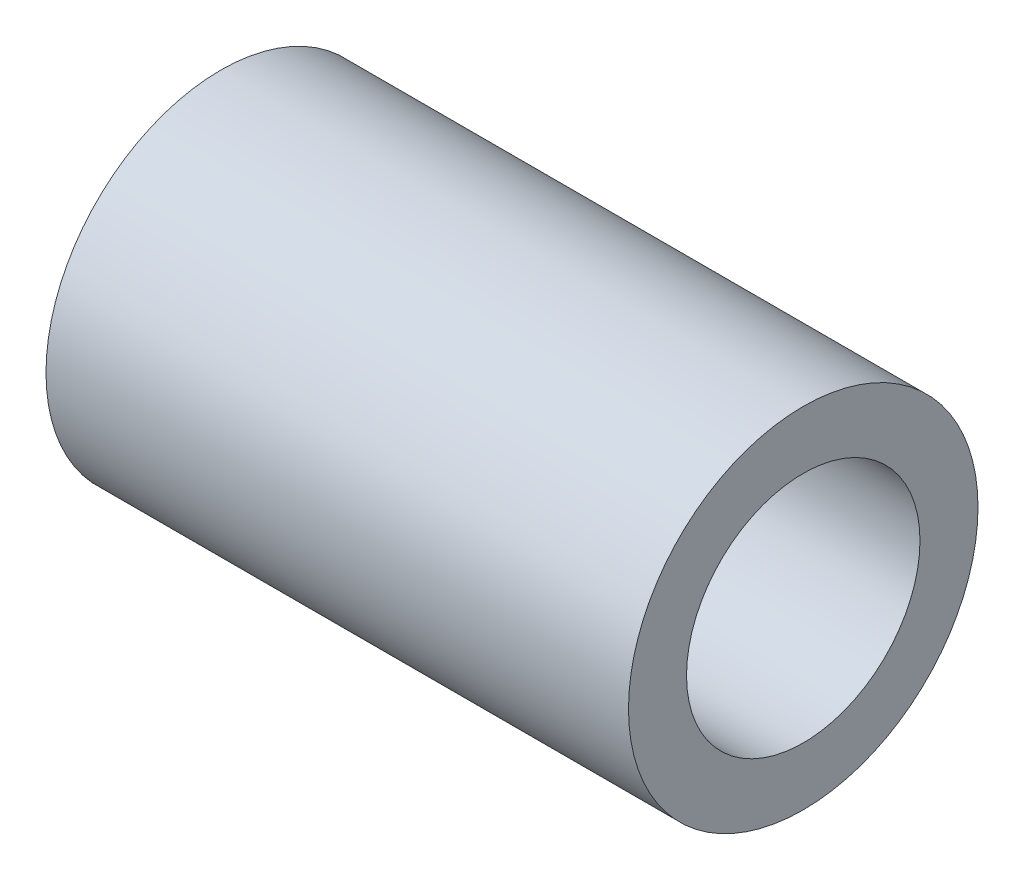
ISO-10303-21;
HEADER;
FILE_DESCRIPTION(('STEP AP214'),'2;1');
FILE_NAME('part.step','',(''),(''),'','','');
FILE_SCHEMA(('AUTOMOTIVE_DESIGN { 1 0 10303 214 1 1 1 1 }'));
ENDSEC;
DATA;
#1=APPLICATION_CONTEXT('core data for automotive mechanical design processes');
#2=APPLICATION_PROTOCOL_DEFINITION('international standard','automotive_design',2000,#1);
#3=PRODUCT_CONTEXT('',#1,'mechanical');
#4=PRODUCT('Part','Part','',(#3));
#5=PRODUCT_RELATED_PRODUCT_CATEGORY('part','',(#4));
#6=PRODUCT_DEFINITION_FORMATION('','',#4);
#7=PRODUCT_DEFINITION_CONTEXT('part definition',#1,'design');
#8=PRODUCT_DEFINITION('design','',#6,#7);
#9=PRODUCT_DEFINITION_SHAPE('','',#8);
#10=(LENGTH_UNIT() NAMED_UNIT(*) SI_UNIT(.MILLI.,.METRE.));
#11=(NAMED_UNIT(*) PLANE_ANGLE_UNIT() SI_UNIT($,.RADIAN.));
#12=(NAMED_UNIT(*) SI_UNIT($,.STERADIAN.) SOLID_ANGLE_UNIT());
#13=UNCERTAINTY_MEASURE_WITH_UNIT(LENGTH_MEASURE(1.E-05),#10,'distance_accuracy_value','');
#14=(GEOMETRIC_REPRESENTATION_CONTEXT(3) GLOBAL_UNCERTAINTY_ASSIGNED_CONTEXT((#13)) GLOBAL_UNIT_ASSIGNED_CONTEXT((#10,
#11,#12)) REPRESENTATION_CONTEXT('',''));
#15=CARTESIAN_POINT('',(0.,0.,0.));
#16=DIRECTION('',(0.,0.,1.));
#17=DIRECTION('',(1.,0.,0.));
#18=AXIS2_PLACEMENT_3D('',#15,#16,#17);
#19=CARTESIAN_POINT('',(0.,9.525,0.));
#20=DIRECTION('',(1.,0.,0.));
#21=DIRECTION('',(0.,0.,-1.));
#22=AXIS2_PLACEMENT_3D('',#19,#20,#21);
#23=PLANE('',#22);
#24=CARTESIAN_POINT('',(0.,0.,0.));
#25=DIRECTION('',(-1.,0.,0.));
#26=DIRECTION('',(0.,0.,1.));
#27=AXIS2_PLACEMENT_3D('',#24,#25,#26);
#28=CIRCLE('',#27,6.3627);
#29=CARTESIAN_POINT('',(0.,0.,6.3627));
#30=VERTEX_POINT('',#29);
#31=EDGE_CURVE('E10',#30,#30,#28,.T.);
#32=ORIENTED_EDGE('',*,*,#31,.F.);
#33=EDGE_LOOP('',(#32));
#34=FACE_BOUND('',#33,.T.);
#35=CARTESIAN_POINT('',(0.,0.,0.));
#36=DIRECTION('',(-1.,0.,0.));
#37=DIRECTION('',(0.,0.,1.));
#38=AXIS2_PLACEMENT_3D('',#35,#36,#37);
#39=CIRCLE('',#38,9.525);
#40=CARTESIAN_POINT('',(0.,0.,9.525));
#41=VERTEX_POINT('',#40);
#42=EDGE_CURVE('E36',#41,#41,#39,.T.);
#43=ORIENTED_EDGE('',*,*,#42,.T.);
#44=EDGE_LOOP('',(#43));
#45=FACE_BOUND('',#44,.T.);
#46=ADVANCED_FACE('F22',(#34,#45),#23,.F.);
#47=CARTESIAN_POINT('',(0.,0.,0.));
#48=DIRECTION('',(-1.,0.,0.));
#49=DIRECTION('',(0.,0.,1.));
#50=AXIS2_PLACEMENT_3D('',#47,#48,#49);
#51=CYLINDRICAL_SURFACE('',#50,6.3627);
#52=CARTESIAN_POINT('',(31.75,0.,0.));
#53=DIRECTION('',(-1.,0.,0.));
#54=DIRECTION('',(0.,0.,1.));
#55=AXIS2_PLACEMENT_3D('',#52,#53,#54);
#56=CIRCLE('',#55,6.3627);
#57=CARTESIAN_POINT('',(31.75,0.,6.3627));
#58=VERTEX_POINT('',#57);
#59=EDGE_CURVE('E28',#58,#58,#56,.T.);
#60=ORIENTED_EDGE('',*,*,#59,.F.);
#61=EDGE_LOOP('',(#60));
#62=FACE_BOUND('',#61,.T.);
#63=ORIENTED_EDGE('',*,*,#31,.T.);
#64=EDGE_LOOP('',(#63));
#65=FACE_BOUND('',#64,.T.);
#66=ADVANCED_FACE('F51',(#62,#65),#51,.F.);
#67=CARTESIAN_POINT('',(31.75,9.525,0.));
#68=DIRECTION('',(-1.,0.,0.));
#69=DIRECTION('',(0.,0.,1.));
#70=AXIS2_PLACEMENT_3D('',#67,#68,#69);
#71=PLANE('',#70);
#72=CARTESIAN_POINT('',(31.75,0.,0.));
#73=DIRECTION('',(-1.,0.,0.));
#74=DIRECTION('',(0.,0.,1.));
#75=AXIS2_PLACEMENT_3D('',#72,#73,#74);
#76=CIRCLE('',#75,9.525);
#77=CARTESIAN_POINT('',(31.75,0.,9.525));
#78=VERTEX_POINT('',#77);
#79=EDGE_CURVE('E32',#78,#78,#76,.T.);
#80=ORIENTED_EDGE('',*,*,#79,.F.);
#81=EDGE_LOOP('',(#80));
#82=FACE_BOUND('',#81,.T.);
#83=ORIENTED_EDGE('',*,*,#59,.T.);
#84=EDGE_LOOP('',(#83));
#85=FACE_BOUND('',#84,.T.);
#86=ADVANCED_FACE('F46',(#82,#85),#71,.F.);
#87=CARTESIAN_POINT('',(0.,0.,0.));
#88=DIRECTION('',(-1.,0.,0.));
#89=DIRECTION('',(0.,0.,1.));
#90=AXIS2_PLACEMENT_3D('',#87,#88,#89);
#91=CYLINDRICAL_SURFACE('',#90,9.525);
#92=ORIENTED_EDGE('',*,*,#42,.F.);
#93=EDGE_LOOP('',(#92));
#94=FACE_BOUND('',#93,.T.);
#95=ORIENTED_EDGE('',*,*,#79,.T.);
#96=EDGE_LOOP('',(#95));
#97=FACE_BOUND('',#96,.T.);
#98=ADVANCED_FACE('F43',(#94,#97),#91,.T.);
#99=CLOSED_SHELL('',(#46,#66,#86,#98));
#100=MANIFOLD_SOLID_BREP('B2',#99);
#101=ADVANCED_BREP_SHAPE_REPRESENTATION('',(#18,#100),#14);
#102=SHAPE_DEFINITION_REPRESENTATION(#9,#101);
ENDSEC;
END-ISO-10303-21;
